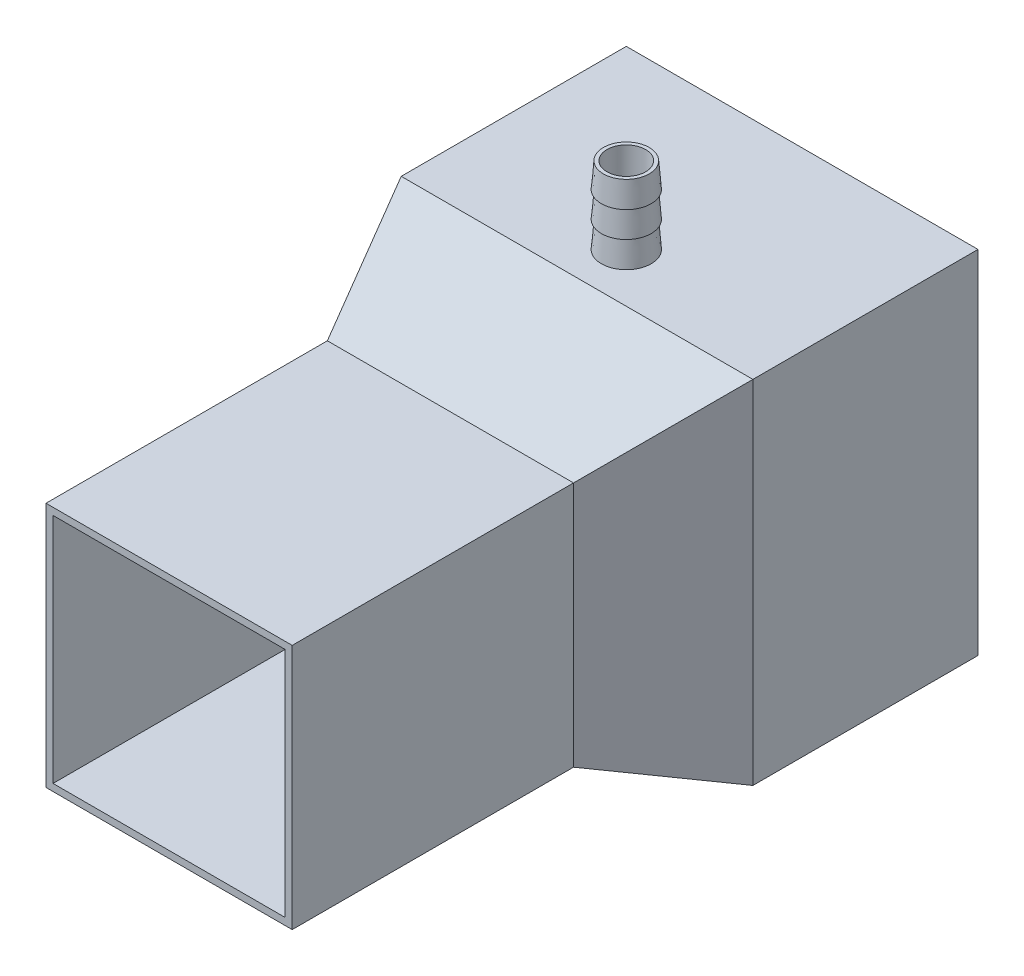
ISO-10303-21;
HEADER;
FILE_DESCRIPTION(('STEP AP214'),'2;1');
FILE_NAME('part.step','',(''),(''),'','','');
FILE_SCHEMA(('AUTOMOTIVE_DESIGN { 1 0 10303 214 1 1 1 1 }'));
ENDSEC;
DATA;
#1=APPLICATION_CONTEXT('core data for automotive mechanical design processes');
#2=APPLICATION_PROTOCOL_DEFINITION('international standard','automotive_design',2000,#1);
#3=PRODUCT_CONTEXT('',#1,'mechanical');
#4=PRODUCT('Part','Part','',(#3));
#5=PRODUCT_RELATED_PRODUCT_CATEGORY('part','',(#4));
#6=PRODUCT_DEFINITION_FORMATION('','',#4);
#7=PRODUCT_DEFINITION_CONTEXT('part definition',#1,'design');
#8=PRODUCT_DEFINITION('design','',#6,#7);
#9=PRODUCT_DEFINITION_SHAPE('','',#8);
#10=(LENGTH_UNIT() NAMED_UNIT(*) SI_UNIT(.MILLI.,.METRE.));
#11=(NAMED_UNIT(*) PLANE_ANGLE_UNIT() SI_UNIT($,.RADIAN.));
#12=(NAMED_UNIT(*) SI_UNIT($,.STERADIAN.) SOLID_ANGLE_UNIT());
#13=UNCERTAINTY_MEASURE_WITH_UNIT(LENGTH_MEASURE(1.E-05),#10,'distance_accuracy_value','');
#14=(GEOMETRIC_REPRESENTATION_CONTEXT(3) GLOBAL_UNCERTAINTY_ASSIGNED_CONTEXT((#13)) GLOBAL_UNIT_ASSIGNED_CONTEXT((#10,
#11,#12)) REPRESENTATION_CONTEXT('',''));
#15=CARTESIAN_POINT('',(0.,0.,0.));
#16=DIRECTION('',(0.,0.,1.));
#17=DIRECTION('',(1.,0.,0.));
#18=AXIS2_PLACEMENT_3D('',#15,#16,#17);
#19=CARTESIAN_POINT('',(0.,9.0728769426227,1.26984070723911));
#20=DIRECTION('',(0.,-1.,0.));
#21=DIRECTION('',(0.,0.,-1.));
#22=AXIS2_PLACEMENT_3D('',#19,#20,#21);
#23=PLANE('',#22);
#24=CARTESIAN_POINT('',(0.,9.0728769426227,-2.22044604925031E-13));
#25=DIRECTION('',(0.,1.,0.));
#26=DIRECTION('',(0.,0.,1.));
#27=AXIS2_PLACEMENT_3D('',#24,#25,#26);
#28=CIRCLE('',#27,2.75);
#29=CARTESIAN_POINT('',(0.,9.07287694262269,2.74999999999978));
#30=VERTEX_POINT('',#29);
#31=EDGE_CURVE('E83',#30,#30,#28,.T.);
#32=ORIENTED_EDGE('',*,*,#31,.T.);
#33=EDGE_LOOP('',(#32));
#34=FACE_BOUND('',#33,.T.);
#35=CARTESIAN_POINT('',(0.,9.0728769426227,-2.22044604925031E-13));
#36=DIRECTION('',(0.,-1.,0.));
#37=DIRECTION('',(0.,0.,-1.));
#38=AXIS2_PLACEMENT_3D('',#35,#36,#37);
#39=CIRCLE('',#38,3.2564997740311);
#40=CARTESIAN_POINT('',(0.,9.07287694262271,-3.25649977403132));
#41=VERTEX_POINT('',#40);
#42=EDGE_CURVE('E80',#41,#41,#39,.T.);
#43=ORIENTED_EDGE('',*,*,#42,.T.);
#44=EDGE_LOOP('',(#43));
#45=FACE_BOUND('',#44,.T.);
#46=ADVANCED_FACE('F58',(#34,#45),#23,.T.);
#47=CARTESIAN_POINT('',(0.,20.0000000000001,1.26984070723914));
#48=DIRECTION('',(0.,1.,0.));
#49=DIRECTION('',(0.,0.,1.));
#50=AXIS2_PLACEMENT_3D('',#47,#48,#49);
#51=PLANE('',#50);
#52=CARTESIAN_POINT('',(0.,20.0000000000001,-1.80411241501588E-13));
#53=DIRECTION('',(0.,1.,0.));
#54=DIRECTION('',(0.,0.,1.));
#55=AXIS2_PLACEMENT_3D('',#52,#53,#54);
#56=CIRCLE('',#55,2.75);
#57=CARTESIAN_POINT('',(0.,20.0000000000001,2.74999999999982));
#58=VERTEX_POINT('',#57);
#59=EDGE_CURVE('E84',#58,#58,#56,.T.);
#60=ORIENTED_EDGE('',*,*,#59,.F.);
#61=EDGE_LOOP('',(#60));
#62=FACE_BOUND('',#61,.T.);
#63=CARTESIAN_POINT('',(0.,20.0000000000001,-1.80411241501588E-13));
#64=DIRECTION('',(0.,-1.,0.));
#65=DIRECTION('',(0.,0.,-1.));
#66=AXIS2_PLACEMENT_3D('',#63,#64,#65);
#67=CIRCLE('',#66,3.53968141447866);
#68=CARTESIAN_POINT('',(0.,20.0000000000002,-3.53968141447884));
#69=VERTEX_POINT('',#68);
#70=EDGE_CURVE('E11',#69,#69,#67,.T.);
#71=ORIENTED_EDGE('',*,*,#70,.F.);
#72=EDGE_LOOP('',(#71));
#73=FACE_BOUND('',#72,.T.);
#74=ADVANCED_FACE('F99',(#62,#73),#51,.T.);
#75=CARTESIAN_POINT('',(0.,20.0000000000001,-1.80411241501588E-13));
#76=DIRECTION('',(0.,1.,0.));
#77=DIRECTION('',(0.,0.,1.));
#78=AXIS2_PLACEMENT_3D('',#75,#76,#77);
#79=CONICAL_SURFACE('',#78,3.53968141447866,0.0792126806704468);
#80=CARTESIAN_POINT('',(0.,16.2858146268847,-1.94289029309402E-13));
#81=DIRECTION('',(0.,-1.,0.));
#82=DIRECTION('',(0.,0.,-1.));
#83=AXIS2_PLACEMENT_3D('',#80,#81,#82);
#84=CIRCLE('',#83,3.24485393015888);
#85=CARTESIAN_POINT('',(0.,16.2858146268847,-3.24485393015907));
#86=VERTEX_POINT('',#85);
#87=EDGE_CURVE('E64',#86,#86,#84,.T.);
#88=ORIENTED_EDGE('',*,*,#87,.F.);
#89=EDGE_LOOP('',(#88));
#90=FACE_BOUND('',#89,.T.);
#91=ORIENTED_EDGE('',*,*,#70,.T.);
#92=EDGE_LOOP('',(#91));
#93=FACE_BOUND('',#92,.T.);
#94=ADVANCED_FACE('F102',(#90,#93),#79,.T.);
#95=CARTESIAN_POINT('',(0.,16.2858146268847,1.26984070723913));
#96=DIRECTION('',(0.,-1.,0.));
#97=DIRECTION('',(0.,0.,-1.));
#98=AXIS2_PLACEMENT_3D('',#95,#96,#97);
#99=PLANE('',#98);
#100=CARTESIAN_POINT('',(0.,16.2858146268847,-1.94289029309402E-13));
#101=DIRECTION('',(0.,-1.,0.));
#102=DIRECTION('',(0.,0.,-1.));
#103=AXIS2_PLACEMENT_3D('',#100,#101,#102);
#104=CIRCLE('',#103,3.53695393015888);
#105=CARTESIAN_POINT('',(0.,16.2858146268847,-3.53695393015907));
#106=VERTEX_POINT('',#105);
#107=EDGE_CURVE('E68',#106,#106,#104,.T.);
#108=ORIENTED_EDGE('',*,*,#107,.F.);
#109=EDGE_LOOP('',(#108));
#110=FACE_BOUND('',#109,.T.);
#111=ORIENTED_EDGE('',*,*,#87,.T.);
#112=EDGE_LOOP('',(#111));
#113=FACE_BOUND('',#112,.T.);
#114=ADVANCED_FACE('F107',(#110,#113),#99,.F.);
#115=CARTESIAN_POINT('',(0.,16.2858146268847,-1.94289029309402E-13));
#116=DIRECTION('',(0.,1.,0.));
#117=DIRECTION('',(0.,0.,1.));
#118=AXIS2_PLACEMENT_3D('',#115,#116,#117);
#119=CONICAL_SURFACE('',#118,3.53695393015888,0.0792126806704446);
#120=CARTESIAN_POINT('',(0.,12.6059896268847,-2.08166817117217E-13));
#121=DIRECTION('',(0.,-1.,0.));
#122=DIRECTION('',(0.,0.,-1.));
#123=AXIS2_PLACEMENT_3D('',#120,#121,#122);
#124=CIRCLE('',#123,3.24485393015888);
#125=CARTESIAN_POINT('',(0.,12.6059896268847,-3.24485393015909));
#126=VERTEX_POINT('',#125);
#127=EDGE_CURVE('E72',#126,#126,#124,.T.);
#128=ORIENTED_EDGE('',*,*,#127,.F.);
#129=EDGE_LOOP('',(#128));
#130=FACE_BOUND('',#129,.T.);
#131=ORIENTED_EDGE('',*,*,#107,.T.);
#132=EDGE_LOOP('',(#131));
#133=FACE_BOUND('',#132,.T.);
#134=ADVANCED_FACE('F113',(#130,#133),#119,.T.);
#135=CARTESIAN_POINT('',(0.,12.6059896268847,1.26984070723912));
#136=DIRECTION('',(0.,-1.,0.));
#137=DIRECTION('',(0.,0.,-1.));
#138=AXIS2_PLACEMENT_3D('',#135,#136,#137);
#139=PLANE('',#138);
#140=CARTESIAN_POINT('',(0.,12.6059896268847,-2.08166817117217E-13));
#141=DIRECTION('',(0.,-1.,0.));
#142=DIRECTION('',(0.,0.,-1.));
#143=AXIS2_PLACEMENT_3D('',#140,#141,#142);
#144=CIRCLE('',#143,3.53695393015888);
#145=CARTESIAN_POINT('',(0.,12.6059896268847,-3.53695393015909));
#146=VERTEX_POINT('',#145);
#147=EDGE_CURVE('E77',#146,#146,#144,.T.);
#148=ORIENTED_EDGE('',*,*,#147,.F.);
#149=EDGE_LOOP('',(#148));
#150=FACE_BOUND('',#149,.T.);
#151=ORIENTED_EDGE('',*,*,#127,.T.);
#152=EDGE_LOOP('',(#151));
#153=FACE_BOUND('',#152,.T.);
#154=ADVANCED_FACE('F117',(#150,#153),#139,.F.);
#155=CARTESIAN_POINT('',(0.,12.6059896268847,-2.08166817117217E-13));
#156=DIRECTION('',(0.,1.,0.));
#157=DIRECTION('',(0.,0.,1.));
#158=AXIS2_PLACEMENT_3D('',#155,#156,#157);
#159=CONICAL_SURFACE('',#158,3.53695393015888,0.0792126806704447);
#160=ORIENTED_EDGE('',*,*,#42,.F.);
#161=EDGE_LOOP('',(#160));
#162=FACE_BOUND('',#161,.T.);
#163=ORIENTED_EDGE('',*,*,#147,.T.);
#164=EDGE_LOOP('',(#163));
#165=FACE_BOUND('',#164,.T.);
#166=ADVANCED_FACE('F95',(#162,#165),#159,.T.);
#167=CARTESIAN_POINT('',(0.,9.0728769426227,-2.22044604925031E-13));
#168=DIRECTION('',(0.,1.,0.));
#169=DIRECTION('',(0.,0.,1.));
#170=AXIS2_PLACEMENT_3D('',#167,#168,#169);
#171=CYLINDRICAL_SURFACE('',#170,2.75);
#172=ORIENTED_EDGE('',*,*,#31,.F.);
#173=EDGE_LOOP('',(#172));
#174=FACE_BOUND('',#173,.T.);
#175=ORIENTED_EDGE('',*,*,#59,.T.);
#176=EDGE_LOOP('',(#175));
#177=FACE_BOUND('',#176,.T.);
#178=ADVANCED_FACE('F92',(#174,#177),#171,.F.);
#179=CLOSED_SHELL('',(#46,#74,#94,#114,#134,#154,#166,#178));
#180=MANIFOLD_SOLID_BREP('B2',#179);
#181=CARTESIAN_POINT('',(0.,80.9271230573773,-1.26984070723988));
#182=DIRECTION('',(0.,1.,0.));
#183=DIRECTION('',(0.,0.,1.));
#184=AXIS2_PLACEMENT_3D('',#181,#182,#183);
#185=PLANE('',#184);
#186=CARTESIAN_POINT('',(0.,80.9271230573773,-5.62050406216485E-13));
#187=DIRECTION('',(0.,-1.,0.));
#188=DIRECTION('',(0.,0.,-1.));
#189=AXIS2_PLACEMENT_3D('',#186,#187,#188);
#190=CIRCLE('',#189,2.75);
#191=CARTESIAN_POINT('',(0.,80.9271230573773,-2.75000000000056));
#192=VERTEX_POINT('',#191);
#193=EDGE_CURVE('E220',#192,#192,#190,.T.);
#194=ORIENTED_EDGE('',*,*,#193,.T.);
#195=EDGE_LOOP('',(#194));
#196=FACE_BOUND('',#195,.T.);
#197=CARTESIAN_POINT('',(0.,80.9271230573773,-5.62050406216485E-13));
#198=DIRECTION('',(0.,1.,0.));
#199=DIRECTION('',(0.,0.,1.));
#200=AXIS2_PLACEMENT_3D('',#197,#198,#199);
#201=CIRCLE('',#200,3.2564997740311);
#202=CARTESIAN_POINT('',(0.,80.9271230573774,3.25649977403054));
#203=VERTEX_POINT('',#202);
#204=EDGE_CURVE('E217',#203,#203,#201,.T.);
#205=ORIENTED_EDGE('',*,*,#204,.T.);
#206=EDGE_LOOP('',(#205));
#207=FACE_BOUND('',#206,.T.);
#208=ADVANCED_FACE('F195',(#196,#207),#185,.T.);
#209=CARTESIAN_POINT('',(0.,69.9999999999999,-1.26984070723982));
#210=DIRECTION('',(0.,-1.,0.));
#211=DIRECTION('',(0.,0.,-1.));
#212=AXIS2_PLACEMENT_3D('',#209,#210,#211);
#213=PLANE('',#212);
#214=CARTESIAN_POINT('',(0.,69.9999999999999,-5.06539254985228E-13));
#215=DIRECTION('',(0.,-1.,0.));
#216=DIRECTION('',(0.,0.,-1.));
#217=AXIS2_PLACEMENT_3D('',#214,#215,#216);
#218=CIRCLE('',#217,2.75);
#219=CARTESIAN_POINT('',(0.,69.9999999999999,-2.75000000000051));
#220=VERTEX_POINT('',#219);
#221=EDGE_CURVE('E221',#220,#220,#218,.T.);
#222=ORIENTED_EDGE('',*,*,#221,.F.);
#223=EDGE_LOOP('',(#222));
#224=FACE_BOUND('',#223,.T.);
#225=CARTESIAN_POINT('',(0.,69.9999999999999,-5.06539254985228E-13));
#226=DIRECTION('',(0.,1.,0.));
#227=DIRECTION('',(0.,0.,1.));
#228=AXIS2_PLACEMENT_3D('',#225,#226,#227);
#229=CIRCLE('',#228,3.53968141447866);
#230=CARTESIAN_POINT('',(0.,69.9999999999999,3.53968141447815));
#231=VERTEX_POINT('',#230);
#232=EDGE_CURVE('E57',#231,#231,#229,.T.);
#233=ORIENTED_EDGE('',*,*,#232,.F.);
#234=EDGE_LOOP('',(#233));
#235=FACE_BOUND('',#234,.T.);
#236=ADVANCED_FACE('F236',(#224,#235),#213,.T.);
#237=CARTESIAN_POINT('',(0.,69.9999999999999,-5.06539254985228E-13));
#238=DIRECTION('',(0.,-1.,0.));
#239=DIRECTION('',(0.,0.,-1.));
#240=AXIS2_PLACEMENT_3D('',#237,#238,#239);
#241=CONICAL_SURFACE('',#240,3.53968141447866,0.0792126806704468);
#242=CARTESIAN_POINT('',(0.,73.7141853731154,-5.34294830600857E-13));
#243=DIRECTION('',(0.,1.,0.));
#244=DIRECTION('',(0.,0.,1.));
#245=AXIS2_PLACEMENT_3D('',#242,#243,#244);
#246=CIRCLE('',#245,3.24485393015888);
#247=CARTESIAN_POINT('',(0.,73.7141853731154,3.24485393015834));
#248=VERTEX_POINT('',#247);
#249=EDGE_CURVE('E201',#248,#248,#246,.T.);
#250=ORIENTED_EDGE('',*,*,#249,.F.);
#251=EDGE_LOOP('',(#250));
#252=FACE_BOUND('',#251,.T.);
#253=ORIENTED_EDGE('',*,*,#232,.T.);
#254=EDGE_LOOP('',(#253));
#255=FACE_BOUND('',#254,.T.);
#256=ADVANCED_FACE('F239',(#252,#255),#241,.T.);
#257=CARTESIAN_POINT('',(0.,73.7141853731154,-1.26984070723985));
#258=DIRECTION('',(0.,1.,0.));
#259=DIRECTION('',(0.,0.,1.));
#260=AXIS2_PLACEMENT_3D('',#257,#258,#259);
#261=PLANE('',#260);
#262=CARTESIAN_POINT('',(0.,73.7141853731154,-5.34294830600857E-13));
#263=DIRECTION('',(0.,1.,0.));
#264=DIRECTION('',(0.,0.,1.));
#265=AXIS2_PLACEMENT_3D('',#262,#263,#264);
#266=CIRCLE('',#265,3.53695393015888);
#267=CARTESIAN_POINT('',(0.,73.7141853731154,3.53695393015834));
#268=VERTEX_POINT('',#267);
#269=EDGE_CURVE('E205',#268,#268,#266,.T.);
#270=ORIENTED_EDGE('',*,*,#269,.F.);
#271=EDGE_LOOP('',(#270));
#272=FACE_BOUND('',#271,.T.);
#273=ORIENTED_EDGE('',*,*,#249,.T.);
#274=EDGE_LOOP('',(#273));
#275=FACE_BOUND('',#274,.T.);
#276=ADVANCED_FACE('F244',(#272,#275),#261,.F.);
#277=CARTESIAN_POINT('',(0.,73.7141853731154,-5.34294830600857E-13));
#278=DIRECTION('',(0.,-1.,0.));
#279=DIRECTION('',(0.,0.,-1.));
#280=AXIS2_PLACEMENT_3D('',#277,#278,#279);
#281=CONICAL_SURFACE('',#280,3.53695393015888,0.0792126806704446);
#282=CARTESIAN_POINT('',(0.,77.3940103731154,-5.34294830600857E-13));
#283=DIRECTION('',(0.,1.,0.));
#284=DIRECTION('',(0.,0.,1.));
#285=AXIS2_PLACEMENT_3D('',#282,#283,#284);
#286=CIRCLE('',#285,3.24485393015888);
#287=CARTESIAN_POINT('',(0.,77.3940103731154,3.24485393015834));
#288=VERTEX_POINT('',#287);
#289=EDGE_CURVE('E209',#288,#288,#286,.T.);
#290=ORIENTED_EDGE('',*,*,#289,.F.);
#291=EDGE_LOOP('',(#290));
#292=FACE_BOUND('',#291,.T.);
#293=ORIENTED_EDGE('',*,*,#269,.T.);
#294=EDGE_LOOP('',(#293));
#295=FACE_BOUND('',#294,.T.);
#296=ADVANCED_FACE('F250',(#292,#295),#281,.T.);
#297=CARTESIAN_POINT('',(0.,77.3940103731154,-1.26984070723985));
#298=DIRECTION('',(0.,1.,0.));
#299=DIRECTION('',(0.,0.,1.));
#300=AXIS2_PLACEMENT_3D('',#297,#298,#299);
#301=PLANE('',#300);
#302=CARTESIAN_POINT('',(0.,77.3940103731154,-5.34294830600857E-13));
#303=DIRECTION('',(0.,1.,0.));
#304=DIRECTION('',(0.,0.,1.));
#305=AXIS2_PLACEMENT_3D('',#302,#303,#304);
#306=CIRCLE('',#305,3.53695393015888);
#307=CARTESIAN_POINT('',(0.,77.3940103731154,3.53695393015835));
#308=VERTEX_POINT('',#307);
#309=EDGE_CURVE('E214',#308,#308,#306,.T.);
#310=ORIENTED_EDGE('',*,*,#309,.F.);
#311=EDGE_LOOP('',(#310));
#312=FACE_BOUND('',#311,.T.);
#313=ORIENTED_EDGE('',*,*,#289,.T.);
#314=EDGE_LOOP('',(#313));
#315=FACE_BOUND('',#314,.T.);
#316=ADVANCED_FACE('F254',(#312,#315),#301,.F.);
#317=CARTESIAN_POINT('',(0.,77.3940103731154,-5.34294830600857E-13));
#318=DIRECTION('',(0.,-1.,0.));
#319=DIRECTION('',(0.,0.,-1.));
#320=AXIS2_PLACEMENT_3D('',#317,#318,#319);
#321=CONICAL_SURFACE('',#320,3.53695393015888,0.0792126806704447);
#322=ORIENTED_EDGE('',*,*,#204,.F.);
#323=EDGE_LOOP('',(#322));
#324=FACE_BOUND('',#323,.T.);
#325=ORIENTED_EDGE('',*,*,#309,.T.);
#326=EDGE_LOOP('',(#325));
#327=FACE_BOUND('',#326,.T.);
#328=ADVANCED_FACE('F232',(#324,#327),#321,.T.);
#329=CARTESIAN_POINT('',(0.,80.9271230573773,-5.62050406216485E-13));
#330=DIRECTION('',(0.,-1.,0.));
#331=DIRECTION('',(0.,0.,-1.));
#332=AXIS2_PLACEMENT_3D('',#329,#330,#331);
#333=CYLINDRICAL_SURFACE('',#332,2.75);
#334=ORIENTED_EDGE('',*,*,#193,.F.);
#335=EDGE_LOOP('',(#334));
#336=FACE_BOUND('',#335,.T.);
#337=ORIENTED_EDGE('',*,*,#221,.T.);
#338=EDGE_LOOP('',(#337));
#339=FACE_BOUND('',#338,.T.);
#340=ADVANCED_FACE('F229',(#336,#339),#333,.F.);
#341=CLOSED_SHELL('',(#208,#236,#256,#276,#296,#316,#328,#340));
#342=MANIFOLD_SOLID_BREP('B6',#341);
#343=CARTESIAN_POINT('',(25.,70.,25.));
#344=DIRECTION('',(-1.,0.,0.));
#345=DIRECTION('',(0.,0.,1.));
#346=AXIS2_PLACEMENT_3D('',#343,#344,#345);
#347=PLANE('',#346);
#348=DIRECTION('',(0.,0.,-1.));
#349=VECTOR('',#348,1.);
#350=CARTESIAN_POINT('',(25.,70.,25.));
#351=LINE('',#350,#349);
#352=CARTESIAN_POINT('',(25.,70.,7.));
#353=VERTEX_POINT('',#352);
#354=CARTESIAN_POINT('',(25.,70.,-25.));
#355=VERTEX_POINT('',#354);
#356=EDGE_CURVE('E631',#353,#355,#351,.T.);
#357=ORIENTED_EDGE('',*,*,#356,.F.);
#358=DIRECTION('',(0.,-1.,0.));
#359=VECTOR('',#358,1.);
#360=CARTESIAN_POINT('',(25.,70.,7.));
#361=LINE('',#360,#359);
#362=CARTESIAN_POINT('',(25.,20.,7.));
#363=VERTEX_POINT('',#362);
#364=EDGE_CURVE('E523',#353,#363,#361,.T.);
#365=ORIENTED_EDGE('',*,*,#364,.T.);
#366=DIRECTION('',(0.,0.,-1.));
#367=VECTOR('',#366,1.);
#368=CARTESIAN_POINT('',(25.,20.,25.));
#369=LINE('',#368,#367);
#370=CARTESIAN_POINT('',(25.,20.,-25.));
#371=VERTEX_POINT('',#370);
#372=EDGE_CURVE('E630',#363,#371,#369,.T.);
#373=ORIENTED_EDGE('',*,*,#372,.T.);
#374=DIRECTION('',(0.,-1.,0.));
#375=VECTOR('',#374,1.);
#376=CARTESIAN_POINT('',(25.,70.,-25.));
#377=LINE('',#376,#375);
#378=EDGE_CURVE('E654',#355,#371,#377,.T.);
#379=ORIENTED_EDGE('',*,*,#378,.F.);
#380=EDGE_LOOP('',(#357,#365,#373,#379));
#381=FACE_BOUND('',#380,.T.);
#382=ADVANCED_FACE('F323',(#381),#347,.F.);
#383=CARTESIAN_POINT('',(-25.,70.,-25.));
#384=DIRECTION('',(0.,0.,-1.));
#385=DIRECTION('',(-1.,0.,0.));
#386=AXIS2_PLACEMENT_3D('',#383,#384,#385);
#387=PLANE('',#386);
#388=DIRECTION('',(1.,0.,0.));
#389=VECTOR('',#388,1.);
#390=CARTESIAN_POINT('',(-25.,20.,-25.));
#391=LINE('',#390,#389);
#392=CARTESIAN_POINT('',(-25.,20.,-25.));
#393=VERTEX_POINT('',#392);
#394=EDGE_CURVE('E645',#393,#371,#391,.T.);
#395=ORIENTED_EDGE('',*,*,#394,.F.);
#396=DIRECTION('',(0.,-1.,0.));
#397=VECTOR('',#396,1.);
#398=CARTESIAN_POINT('',(-25.,70.,-25.));
#399=LINE('',#398,#397);
#400=CARTESIAN_POINT('',(-25.,70.,-25.));
#401=VERTEX_POINT('',#400);
#402=EDGE_CURVE('E642',#401,#393,#399,.T.);
#403=ORIENTED_EDGE('',*,*,#402,.F.);
#404=DIRECTION('',(1.,0.,0.));
#405=VECTOR('',#404,1.);
#406=CARTESIAN_POINT('',(-25.,70.,-25.));
#407=LINE('',#406,#405);
#408=EDGE_CURVE('E634',#401,#355,#407,.T.);
#409=ORIENTED_EDGE('',*,*,#408,.T.);
#410=ORIENTED_EDGE('',*,*,#378,.T.);
#411=EDGE_LOOP('',(#395,#403,#409,#410));
#412=FACE_BOUND('',#411,.T.);
#413=ADVANCED_FACE('F676',(#412),#387,.T.);
#414=CARTESIAN_POINT('',(-25.,70.,25.));
#415=DIRECTION('',(-1.,0.,0.));
#416=DIRECTION('',(0.,0.,1.));
#417=AXIS2_PLACEMENT_3D('',#414,#415,#416);
#418=PLANE('',#417);
#419=DIRECTION('',(0.,-1.,0.));
#420=VECTOR('',#419,1.);
#421=CARTESIAN_POINT('',(-25.,70.,7.));
#422=LINE('',#421,#420);
#423=CARTESIAN_POINT('',(-25.,70.,7.));
#424=VERTEX_POINT('',#423);
#425=CARTESIAN_POINT('',(-25.,20.,7.));
#426=VERTEX_POINT('',#425);
#427=EDGE_CURVE('E524',#424,#426,#422,.T.);
#428=ORIENTED_EDGE('',*,*,#427,.F.);
#429=DIRECTION('',(0.,0.,-1.));
#430=VECTOR('',#429,1.);
#431=CARTESIAN_POINT('',(-25.,70.,25.));
#432=LINE('',#431,#430);
#433=EDGE_CURVE('E639',#424,#401,#432,.T.);
#434=ORIENTED_EDGE('',*,*,#433,.T.);
#435=ORIENTED_EDGE('',*,*,#402,.T.);
#436=DIRECTION('',(0.,0.,-1.));
#437=VECTOR('',#436,1.);
#438=CARTESIAN_POINT('',(-25.,20.,25.));
#439=LINE('',#438,#437);
#440=EDGE_CURVE('E635',#426,#393,#439,.T.);
#441=ORIENTED_EDGE('',*,*,#440,.F.);
#442=EDGE_LOOP('',(#428,#434,#435,#441));
#443=FACE_BOUND('',#442,.T.);
#444=ADVANCED_FACE('F680',(#443),#418,.T.);
#445=CARTESIAN_POINT('',(0.,70.,0.));
#446=DIRECTION('',(0.,1.,0.));
#447=DIRECTION('',(0.,0.,1.));
#448=AXIS2_PLACEMENT_3D('',#445,#446,#447);
#449=PLANE('',#448);
#450=CARTESIAN_POINT('',(0.,70.,0.));
#451=DIRECTION('',(0.,1.,0.));
#452=DIRECTION('',(0.,0.,1.));
#453=AXIS2_PLACEMENT_3D('',#450,#451,#452);
#454=CIRCLE('',#453,2.75);
#455=CARTESIAN_POINT('',(0.,70.,2.75));
#456=VERTEX_POINT('',#455);
#457=EDGE_CURVE('E971',#456,#456,#454,.T.);
#458=ORIENTED_EDGE('',*,*,#457,.F.);
#459=EDGE_LOOP('',(#458));
#460=FACE_BOUND('',#459,.T.);
#461=DIRECTION('',(1.,0.,0.));
#462=VECTOR('',#461,1.);
#463=CARTESIAN_POINT('',(-25.,70.,7.));
#464=LINE('',#463,#462);
#465=EDGE_CURVE('E539',#424,#353,#464,.T.);
#466=ORIENTED_EDGE('',*,*,#465,.T.);
#467=ORIENTED_EDGE('',*,*,#356,.T.);
#468=ORIENTED_EDGE('',*,*,#408,.F.);
#469=ORIENTED_EDGE('',*,*,#433,.F.);
#470=EDGE_LOOP('',(#466,#467,#468,#469));
#471=FACE_BOUND('',#470,.T.);
#472=ADVANCED_FACE('F668',(#460,#471),#449,.T.);
#473=CARTESIAN_POINT('',(0.,20.,0.));
#474=DIRECTION('',(0.,1.,0.));
#475=DIRECTION('',(0.,0.,1.));
#476=AXIS2_PLACEMENT_3D('',#473,#474,#475);
#477=PLANE('',#476);
#478=CARTESIAN_POINT('',(0.,20.,0.));
#479=DIRECTION('',(0.,1.,0.));
#480=DIRECTION('',(0.,0.,1.));
#481=AXIS2_PLACEMENT_3D('',#478,#479,#480);
#482=CIRCLE('',#481,2.75);
#483=CARTESIAN_POINT('',(0.,20.,2.75));
#484=VERTEX_POINT('',#483);
#485=EDGE_CURVE('E981',#484,#484,#482,.T.);
#486=ORIENTED_EDGE('',*,*,#485,.T.);
#487=EDGE_LOOP('',(#486));
#488=FACE_BOUND('',#487,.T.);
#489=ORIENTED_EDGE('',*,*,#372,.F.);
#490=DIRECTION('',(1.,0.,0.));
#491=VECTOR('',#490,1.);
#492=CARTESIAN_POINT('',(-25.,20.,7.));
#493=LINE('',#492,#491);
#494=EDGE_CURVE('E538',#426,#363,#493,.T.);
#495=ORIENTED_EDGE('',*,*,#494,.F.);
#496=ORIENTED_EDGE('',*,*,#440,.T.);
#497=ORIENTED_EDGE('',*,*,#394,.T.);
#498=EDGE_LOOP('',(#489,#495,#496,#497));
#499=FACE_BOUND('',#498,.T.);
#500=ADVANCED_FACE('F687',(#488,#499),#477,.F.);
#501=CARTESIAN_POINT('',(0.,0.,65.));
#502=DIRECTION('',(0.,0.,-1.));
#503=DIRECTION('',(-1.,0.,0.));
#504=AXIS2_PLACEMENT_3D('',#501,#502,#503);
#505=PLANE('',#504);
#506=DIRECTION('',(0.,1.,0.));
#507=VECTOR('',#506,1.);
#508=CARTESIAN_POINT('',(17.5,27.5,65.));
#509=LINE('',#508,#507);
#510=CARTESIAN_POINT('',(17.5,27.5,65.));
#511=VERTEX_POINT('',#510);
#512=CARTESIAN_POINT('',(17.5,62.5,65.));
#513=VERTEX_POINT('',#512);
#514=EDGE_CURVE('E588',#511,#513,#509,.T.);
#515=ORIENTED_EDGE('',*,*,#514,.T.);
#516=DIRECTION('',(-1.,0.,0.));
#517=VECTOR('',#516,1.);
#518=CARTESIAN_POINT('',(-17.5,62.5,65.));
#519=LINE('',#518,#517);
#520=CARTESIAN_POINT('',(-17.5,62.5,65.));
#521=VERTEX_POINT('',#520);
#522=EDGE_CURVE('E592',#513,#521,#519,.T.);
#523=ORIENTED_EDGE('',*,*,#522,.T.);
#524=DIRECTION('',(0.,-1.,0.));
#525=VECTOR('',#524,1.);
#526=CARTESIAN_POINT('',(-17.5,27.5,65.));
#527=LINE('',#526,#525);
#528=CARTESIAN_POINT('',(-17.5,27.5,65.));
#529=VERTEX_POINT('',#528);
#530=EDGE_CURVE('E596',#521,#529,#527,.T.);
#531=ORIENTED_EDGE('',*,*,#530,.T.);
#532=DIRECTION('',(1.,0.,0.));
#533=VECTOR('',#532,1.);
#534=CARTESIAN_POINT('',(-17.5,27.5,65.));
#535=LINE('',#534,#533);
#536=EDGE_CURVE('E599',#529,#511,#535,.T.);
#537=ORIENTED_EDGE('',*,*,#536,.T.);
#538=EDGE_LOOP('',(#515,#523,#531,#537));
#539=FACE_BOUND('',#538,.T.);
#540=DIRECTION('',(0.,1.,0.));
#541=VECTOR('',#540,1.);
#542=CARTESIAN_POINT('',(16.5,28.5,65.));
#543=LINE('',#542,#541);
#544=CARTESIAN_POINT('',(16.5,28.5,65.));
#545=VERTEX_POINT('',#544);
#546=CARTESIAN_POINT('',(16.5,61.5,65.));
#547=VERTEX_POINT('',#546);
#548=EDGE_CURVE('E562',#545,#547,#543,.T.);
#549=ORIENTED_EDGE('',*,*,#548,.F.);
#550=DIRECTION('',(1.,0.,0.));
#551=VECTOR('',#550,1.);
#552=CARTESIAN_POINT('',(-16.5,28.5,65.));
#553=LINE('',#552,#551);
#554=CARTESIAN_POINT('',(-16.5,28.5,65.));
#555=VERTEX_POINT('',#554);
#556=EDGE_CURVE('E572',#555,#545,#553,.T.);
#557=ORIENTED_EDGE('',*,*,#556,.F.);
#558=DIRECTION('',(0.,-1.,0.));
#559=VECTOR('',#558,1.);
#560=CARTESIAN_POINT('',(-16.5,28.5,65.));
#561=LINE('',#560,#559);
#562=CARTESIAN_POINT('',(-16.5,61.5,65.));
#563=VERTEX_POINT('',#562);
#564=EDGE_CURVE('E568',#563,#555,#561,.T.);
#565=ORIENTED_EDGE('',*,*,#564,.F.);
#566=DIRECTION('',(-1.,0.,0.));
#567=VECTOR('',#566,1.);
#568=CARTESIAN_POINT('',(-16.5,61.5,65.));
#569=LINE('',#568,#567);
#570=EDGE_CURVE('E565',#547,#563,#569,.T.);
#571=ORIENTED_EDGE('',*,*,#570,.F.);
#572=EDGE_LOOP('',(#549,#557,#565,#571));
#573=FACE_BOUND('',#572,.T.);
#574=ADVANCED_FACE('F689',(#539,#573),#505,.F.);
#575=CARTESIAN_POINT('',(17.5,27.5,65.));
#576=DIRECTION('',(-1.,0.,0.));
#577=DIRECTION('',(0.,0.,1.));
#578=AXIS2_PLACEMENT_3D('',#575,#576,#577);
#579=PLANE('',#578);
#580=DIRECTION('',(0.,1.,0.));
#581=VECTOR('',#580,1.);
#582=CARTESIAN_POINT('',(17.5,27.5,25.));
#583=LINE('',#582,#581);
#584=CARTESIAN_POINT('',(17.5,27.5,25.));
#585=VERTEX_POINT('',#584);
#586=CARTESIAN_POINT('',(17.5,62.5,25.));
#587=VERTEX_POINT('',#586);
#588=EDGE_CURVE('E587',#585,#587,#583,.T.);
#589=ORIENTED_EDGE('',*,*,#588,.T.);
#590=DIRECTION('',(0.,0.,-1.));
#591=VECTOR('',#590,1.);
#592=CARTESIAN_POINT('',(17.5,62.5,65.));
#593=LINE('',#592,#591);
#594=EDGE_CURVE('E626',#513,#587,#593,.T.);
#595=ORIENTED_EDGE('',*,*,#594,.F.);
#596=ORIENTED_EDGE('',*,*,#514,.F.);
#597=DIRECTION('',(0.,0.,-1.));
#598=VECTOR('',#597,1.);
#599=CARTESIAN_POINT('',(17.5,27.5,65.));
#600=LINE('',#599,#598);
#601=EDGE_CURVE('E602',#511,#585,#600,.T.);
#602=ORIENTED_EDGE('',*,*,#601,.T.);
#603=EDGE_LOOP('',(#589,#595,#596,#602));
#604=FACE_BOUND('',#603,.T.);
#605=ADVANCED_FACE('F697',(#604),#579,.F.);
#606=CARTESIAN_POINT('',(-17.5,62.5,65.));
#607=DIRECTION('',(0.,-1.,0.));
#608=DIRECTION('',(0.,0.,-1.));
#609=AXIS2_PLACEMENT_3D('',#606,#607,#608);
#610=PLANE('',#609);
#611=DIRECTION('',(-1.,0.,0.));
#612=VECTOR('',#611,1.);
#613=CARTESIAN_POINT('',(-17.5,62.5,25.));
#614=LINE('',#613,#612);
#615=CARTESIAN_POINT('',(-17.5,62.5,25.));
#616=VERTEX_POINT('',#615);
#617=EDGE_CURVE('E606',#587,#616,#614,.T.);
#618=ORIENTED_EDGE('',*,*,#617,.T.);
#619=DIRECTION('',(0.,0.,-1.));
#620=VECTOR('',#619,1.);
#621=CARTESIAN_POINT('',(-17.5,62.5,65.));
#622=LINE('',#621,#620);
#623=EDGE_CURVE('E622',#521,#616,#622,.T.);
#624=ORIENTED_EDGE('',*,*,#623,.F.);
#625=ORIENTED_EDGE('',*,*,#522,.F.);
#626=ORIENTED_EDGE('',*,*,#594,.T.);
#627=EDGE_LOOP('',(#618,#624,#625,#626));
#628=FACE_BOUND('',#627,.T.);
#629=ADVANCED_FACE('F722',(#628),#610,.F.);
#630=CARTESIAN_POINT('',(-17.5,27.5,65.));
#631=DIRECTION('',(1.,0.,0.));
#632=DIRECTION('',(0.,0.,-1.));
#633=AXIS2_PLACEMENT_3D('',#630,#631,#632);
#634=PLANE('',#633);
#635=DIRECTION('',(0.,-1.,0.));
#636=VECTOR('',#635,1.);
#637=CARTESIAN_POINT('',(-17.5,27.5,25.));
#638=LINE('',#637,#636);
#639=CARTESIAN_POINT('',(-17.5,27.5,25.));
#640=VERTEX_POINT('',#639);
#641=EDGE_CURVE('E347',#616,#640,#638,.T.);
#642=ORIENTED_EDGE('',*,*,#641,.T.);
#643=DIRECTION('',(0.,0.,-1.));
#644=VECTOR('',#643,1.);
#645=CARTESIAN_POINT('',(-17.5,27.5,65.));
#646=LINE('',#645,#644);
#647=EDGE_CURVE('E618',#529,#640,#646,.T.);
#648=ORIENTED_EDGE('',*,*,#647,.F.);
#649=ORIENTED_EDGE('',*,*,#530,.F.);
#650=ORIENTED_EDGE('',*,*,#623,.T.);
#651=EDGE_LOOP('',(#642,#648,#649,#650));
#652=FACE_BOUND('',#651,.T.);
#653=ADVANCED_FACE('F732',(#652),#634,.F.);
#654=CARTESIAN_POINT('',(-17.5,27.5,65.));
#655=DIRECTION('',(0.,1.,0.));
#656=DIRECTION('',(0.,0.,1.));
#657=AXIS2_PLACEMENT_3D('',#654,#655,#656);
#658=PLANE('',#657);
#659=DIRECTION('',(1.,0.,0.));
#660=VECTOR('',#659,1.);
#661=CARTESIAN_POINT('',(-17.5,27.5,25.));
#662=LINE('',#661,#660);
#663=EDGE_CURVE('E593',#640,#585,#662,.T.);
#664=ORIENTED_EDGE('',*,*,#663,.T.);
#665=ORIENTED_EDGE('',*,*,#601,.F.);
#666=ORIENTED_EDGE('',*,*,#536,.F.);
#667=ORIENTED_EDGE('',*,*,#647,.T.);
#668=EDGE_LOOP('',(#664,#665,#666,#667));
#669=FACE_BOUND('',#668,.T.);
#670=ADVANCED_FACE('F741',(#669),#658,.F.);
#671=CARTESIAN_POINT('',(16.5,28.5,65.));
#672=DIRECTION('',(-1.,0.,0.));
#673=DIRECTION('',(0.,0.,1.));
#674=AXIS2_PLACEMENT_3D('',#671,#672,#673);
#675=PLANE('',#674);
#676=DIRECTION('',(0.,0.,-1.));
#677=VECTOR('',#676,1.);
#678=CARTESIAN_POINT('',(16.5,61.5,65.));
#679=LINE('',#678,#677);
#680=CARTESIAN_POINT('',(16.5,61.5,23.));
#681=VERTEX_POINT('',#680);
#682=EDGE_CURVE('E584',#547,#681,#679,.T.);
#683=ORIENTED_EDGE('',*,*,#682,.T.);
#684=DIRECTION('',(0.,1.,0.));
#685=VECTOR('',#684,1.);
#686=CARTESIAN_POINT('',(16.5,0.,23.));
#687=LINE('',#686,#685);
#688=CARTESIAN_POINT('',(16.5,28.5,23.));
#689=VERTEX_POINT('',#688);
#690=EDGE_CURVE('E550',#689,#681,#687,.T.);
#691=ORIENTED_EDGE('',*,*,#690,.F.);
#692=DIRECTION('',(0.,0.,-1.));
#693=VECTOR('',#692,1.);
#694=CARTESIAN_POINT('',(16.5,28.5,65.));
#695=LINE('',#694,#693);
#696=EDGE_CURVE('E575',#545,#689,#695,.T.);
#697=ORIENTED_EDGE('',*,*,#696,.F.);
#698=ORIENTED_EDGE('',*,*,#548,.T.);
#699=EDGE_LOOP('',(#683,#691,#697,#698));
#700=FACE_BOUND('',#699,.T.);
#701=ADVANCED_FACE('F750',(#700),#675,.T.);
#702=CARTESIAN_POINT('',(-16.5,61.5,65.));
#703=DIRECTION('',(0.,-1.,0.));
#704=DIRECTION('',(0.,0.,-1.));
#705=AXIS2_PLACEMENT_3D('',#702,#703,#704);
#706=PLANE('',#705);
#707=DIRECTION('',(0.,0.,-1.));
#708=VECTOR('',#707,1.);
#709=CARTESIAN_POINT('',(-16.5,61.5,65.));
#710=LINE('',#709,#708);
#711=CARTESIAN_POINT('',(-16.5,61.5,23.));
#712=VERTEX_POINT('',#711);
#713=EDGE_CURVE('E581',#563,#712,#710,.T.);
#714=ORIENTED_EDGE('',*,*,#713,.T.);
#715=DIRECTION('',(1.,0.,0.));
#716=VECTOR('',#715,1.);
#717=CARTESIAN_POINT('',(0.,61.5,23.));
#718=LINE('',#717,#716);
#719=EDGE_CURVE('E554',#712,#681,#718,.T.);
#720=ORIENTED_EDGE('',*,*,#719,.T.);
#721=ORIENTED_EDGE('',*,*,#682,.F.);
#722=ORIENTED_EDGE('',*,*,#570,.T.);
#723=EDGE_LOOP('',(#714,#720,#721,#722));
#724=FACE_BOUND('',#723,.T.);
#725=ADVANCED_FACE('F877',(#724),#706,.T.);
#726=CARTESIAN_POINT('',(-16.5,28.5,65.));
#727=DIRECTION('',(1.,0.,0.));
#728=DIRECTION('',(0.,0.,-1.));
#729=AXIS2_PLACEMENT_3D('',#726,#727,#728);
#730=PLANE('',#729);
#731=DIRECTION('',(0.,0.,-1.));
#732=VECTOR('',#731,1.);
#733=CARTESIAN_POINT('',(-16.5,28.5,65.));
#734=LINE('',#733,#732);
#735=CARTESIAN_POINT('',(-16.5,28.5,23.));
#736=VERTEX_POINT('',#735);
#737=EDGE_CURVE('E578',#555,#736,#734,.T.);
#738=ORIENTED_EDGE('',*,*,#737,.T.);
#739=DIRECTION('',(0.,1.,0.));
#740=VECTOR('',#739,1.);
#741=CARTESIAN_POINT('',(-16.5,0.,23.));
#742=LINE('',#741,#740);
#743=EDGE_CURVE('E558',#736,#712,#742,.T.);
#744=ORIENTED_EDGE('',*,*,#743,.T.);
#745=ORIENTED_EDGE('',*,*,#713,.F.);
#746=ORIENTED_EDGE('',*,*,#564,.T.);
#747=EDGE_LOOP('',(#738,#744,#745,#746));
#748=FACE_BOUND('',#747,.T.);
#749=ADVANCED_FACE('F886',(#748),#730,.T.);
#750=CARTESIAN_POINT('',(-16.5,28.5,65.));
#751=DIRECTION('',(0.,1.,0.));
#752=DIRECTION('',(0.,0.,1.));
#753=AXIS2_PLACEMENT_3D('',#750,#751,#752);
#754=PLANE('',#753);
#755=ORIENTED_EDGE('',*,*,#696,.T.);
#756=DIRECTION('',(1.,0.,0.));
#757=VECTOR('',#756,1.);
#758=CARTESIAN_POINT('',(0.,28.5,23.));
#759=LINE('',#758,#757);
#760=EDGE_CURVE('E543',#736,#689,#759,.T.);
#761=ORIENTED_EDGE('',*,*,#760,.F.);
#762=ORIENTED_EDGE('',*,*,#737,.F.);
#763=ORIENTED_EDGE('',*,*,#556,.T.);
#764=EDGE_LOOP('',(#755,#761,#762,#763));
#765=FACE_BOUND('',#764,.T.);
#766=ADVANCED_FACE('F791',(#765),#754,.T.);
#767=CARTESIAN_POINT('',(0.,0.,23.));
#768=DIRECTION('',(0.,0.,1.));
#769=DIRECTION('',(1.,0.,0.));
#770=AXIS2_PLACEMENT_3D('',#767,#768,#769);
#771=PLANE('',#770);
#772=DIRECTION('',(0.,-1.,0.));
#773=VECTOR('',#772,1.);
#774=CARTESIAN_POINT('',(-16.1666666666667,70.,23.));
#775=LINE('',#774,#773);
#776=CARTESIAN_POINT('',(-16.1666666666667,61.1666666666667,23.));
#777=VERTEX_POINT('',#776);
#778=CARTESIAN_POINT('',(-16.1666666666667,28.8333333333333,23.));
#779=VERTEX_POINT('',#778);
#780=EDGE_CURVE('E517',#777,#779,#775,.T.);
#781=ORIENTED_EDGE('',*,*,#780,.F.);
#782=DIRECTION('',(-1.,0.,0.));
#783=VECTOR('',#782,1.);
#784=CARTESIAN_POINT('',(-25.,61.1666666666667,23.));
#785=LINE('',#784,#783);
#786=CARTESIAN_POINT('',(16.1666666666667,61.1666666666667,23.));
#787=VERTEX_POINT('',#786);
#788=EDGE_CURVE('E514',#787,#777,#785,.T.);
#789=ORIENTED_EDGE('',*,*,#788,.F.);
#790=DIRECTION('',(0.,1.,0.));
#791=VECTOR('',#790,1.);
#792=CARTESIAN_POINT('',(16.1666666666667,70.,23.));
#793=LINE('',#792,#791);
#794=CARTESIAN_POINT('',(16.1666666666667,28.8333333333333,23.));
#795=VERTEX_POINT('',#794);
#796=EDGE_CURVE('E500',#795,#787,#793,.T.);
#797=ORIENTED_EDGE('',*,*,#796,.F.);
#798=DIRECTION('',(1.,0.,0.));
#799=VECTOR('',#798,1.);
#800=CARTESIAN_POINT('',(-25.,28.8333333333333,23.));
#801=LINE('',#800,#799);
#802=EDGE_CURVE('E520',#779,#795,#801,.T.);
#803=ORIENTED_EDGE('',*,*,#802,.F.);
#804=EDGE_LOOP('',(#781,#789,#797,#803));
#805=FACE_BOUND('',#804,.T.);
#806=ORIENTED_EDGE('',*,*,#760,.T.);
#807=ORIENTED_EDGE('',*,*,#690,.T.);
#808=ORIENTED_EDGE('',*,*,#719,.F.);
#809=ORIENTED_EDGE('',*,*,#743,.F.);
#810=EDGE_LOOP('',(#806,#807,#808,#809));
#811=FACE_BOUND('',#810,.T.);
#812=ADVANCED_FACE('F760',(#805,#811),#771,.T.);
#813=CARTESIAN_POINT('',(-25.,20.,7.));
#814=DIRECTION('',(0.,0.923076923076923,-0.384615384615385));
#815=DIRECTION('',(0.,0.384615384615385,0.923076923076923));
#816=AXIS2_PLACEMENT_3D('',#813,#814,#815);
#817=PLANE('',#816);
#818=ORIENTED_EDGE('',*,*,#663,.F.);
#819=DIRECTION('',(-0.358979079308869,-0.358979079308869,-0.861549790341286));
#820=VECTOR('',#819,1.);
#821=CARTESIAN_POINT('',(-25.,20.,7.));
#822=LINE('',#821,#820);
#823=EDGE_CURVE('E534',#640,#426,#822,.T.);
#824=ORIENTED_EDGE('',*,*,#823,.T.);
#825=ORIENTED_EDGE('',*,*,#494,.T.);
#826=DIRECTION('',(-0.358979079308869,0.358979079308869,0.861549790341286));
#827=VECTOR('',#826,1.);
#828=CARTESIAN_POINT('',(18.5567010309278,26.4432989690722,22.4639175257732));
#829=LINE('',#828,#827);
#830=EDGE_CURVE('E527',#363,#585,#829,.T.);
#831=ORIENTED_EDGE('',*,*,#830,.T.);
#832=EDGE_LOOP('',(#818,#824,#825,#831));
#833=FACE_BOUND('',#832,.T.);
#834=ADVANCED_FACE('F685',(#833),#817,.F.);
#835=CARTESIAN_POINT('',(-25.,70.,7.));
#836=DIRECTION('',(0.,-0.923076923076923,-0.384615384615385));
#837=DIRECTION('',(0.,0.384615384615385,-0.923076923076923));
#838=AXIS2_PLACEMENT_3D('',#835,#836,#837);
#839=PLANE('',#838);
#840=ORIENTED_EDGE('',*,*,#465,.F.);
#841=DIRECTION('',(0.358979079308869,-0.358979079308869,0.861549790341286));
#842=VECTOR('',#841,1.);
#843=CARTESIAN_POINT('',(-25.,70.,7.));
#844=LINE('',#843,#842);
#845=EDGE_CURVE('E193',#424,#616,#844,.T.);
#846=ORIENTED_EDGE('',*,*,#845,.T.);
#847=ORIENTED_EDGE('',*,*,#617,.F.);
#848=DIRECTION('',(0.358979079308869,0.358979079308869,-0.861549790341286));
#849=VECTOR('',#848,1.);
#850=CARTESIAN_POINT('',(18.5567010309278,63.5567010309278,22.4639175257732));
#851=LINE('',#850,#849);
#852=EDGE_CURVE('E332',#587,#353,#851,.T.);
#853=ORIENTED_EDGE('',*,*,#852,.T.);
#854=EDGE_LOOP('',(#840,#846,#847,#853));
#855=FACE_BOUND('',#854,.T.);
#856=ADVANCED_FACE('F663',(#855),#839,.F.);
#857=CARTESIAN_POINT('',(25.,70.,7.));
#858=DIRECTION('',(-0.923076923076923,0.,-0.384615384615385));
#859=DIRECTION('',(-0.384615384615385,0.,0.923076923076923));
#860=AXIS2_PLACEMENT_3D('',#857,#858,#859);
#861=PLANE('',#860);
#862=ORIENTED_EDGE('',*,*,#364,.F.);
#863=ORIENTED_EDGE('',*,*,#852,.F.);
#864=ORIENTED_EDGE('',*,*,#588,.F.);
#865=ORIENTED_EDGE('',*,*,#830,.F.);
#866=EDGE_LOOP('',(#862,#863,#864,#865));
#867=FACE_BOUND('',#866,.T.);
#868=ADVANCED_FACE('F769',(#867),#861,.F.);
#869=CARTESIAN_POINT('',(-25.,70.,7.));
#870=DIRECTION('',(0.923076923076923,0.,-0.384615384615385));
#871=DIRECTION('',(-0.384615384615385,0.,-0.923076923076923));
#872=AXIS2_PLACEMENT_3D('',#869,#870,#871);
#873=PLANE('',#872);
#874=ORIENTED_EDGE('',*,*,#641,.F.);
#875=ORIENTED_EDGE('',*,*,#845,.F.);
#876=ORIENTED_EDGE('',*,*,#427,.T.);
#877=ORIENTED_EDGE('',*,*,#823,.F.);
#878=EDGE_LOOP('',(#874,#875,#876,#877));
#879=FACE_BOUND('',#878,.T.);
#880=ADVANCED_FACE('F681',(#879),#873,.F.);
#881=CARTESIAN_POINT('',(23.,70.,25.));
#882=DIRECTION('',(-1.,0.,0.));
#883=DIRECTION('',(0.,0.,1.));
#884=AXIS2_PLACEMENT_3D('',#881,#882,#883);
#885=PLANE('',#884);
#886=DIRECTION('',(0.,0.,-1.));
#887=VECTOR('',#886,1.);
#888=CARTESIAN_POINT('',(23.,68.,25.));
#889=LINE('',#888,#887);
#890=CARTESIAN_POINT('',(23.,68.,6.60000000000001));
#891=VERTEX_POINT('',#890);
#892=CARTESIAN_POINT('',(23.,68.,-23.));
#893=VERTEX_POINT('',#892);
#894=EDGE_CURVE('E449',#891,#893,#889,.T.);
#895=ORIENTED_EDGE('',*,*,#894,.T.);
#896=DIRECTION('',(0.,-1.,0.));
#897=VECTOR('',#896,1.);
#898=CARTESIAN_POINT('',(23.,70.,-23.));
#899=LINE('',#898,#897);
#900=CARTESIAN_POINT('',(23.,22.,-23.));
#901=VERTEX_POINT('',#900);
#902=EDGE_CURVE('E453',#893,#901,#899,.T.);
#903=ORIENTED_EDGE('',*,*,#902,.T.);
#904=DIRECTION('',(0.,0.,-1.));
#905=VECTOR('',#904,1.);
#906=CARTESIAN_POINT('',(23.,22.,25.));
#907=LINE('',#906,#905);
#908=CARTESIAN_POINT('',(23.,22.,6.6));
#909=VERTEX_POINT('',#908);
#910=EDGE_CURVE('E494',#909,#901,#907,.T.);
#911=ORIENTED_EDGE('',*,*,#910,.F.);
#912=DIRECTION('',(0.,-1.,0.));
#913=VECTOR('',#912,1.);
#914=CARTESIAN_POINT('',(23.,70.,6.60000000000001));
#915=LINE('',#914,#913);
#916=EDGE_CURVE('E456',#891,#909,#915,.T.);
#917=ORIENTED_EDGE('',*,*,#916,.F.);
#918=EDGE_LOOP('',(#895,#903,#911,#917));
#919=FACE_BOUND('',#918,.T.);
#920=ADVANCED_FACE('F451',(#919),#885,.T.);
#921=CARTESIAN_POINT('',(-25.,70.,-23.));
#922=DIRECTION('',(0.,0.,-1.));
#923=DIRECTION('',(-1.,0.,0.));
#924=AXIS2_PLACEMENT_3D('',#921,#922,#923);
#925=PLANE('',#924);
#926=DIRECTION('',(1.,0.,0.));
#927=VECTOR('',#926,1.);
#928=CARTESIAN_POINT('',(-25.,22.,-23.));
#929=LINE('',#928,#927);
#930=CARTESIAN_POINT('',(-23.,22.,-23.));
#931=VERTEX_POINT('',#930);
#932=EDGE_CURVE('E469',#931,#901,#929,.T.);
#933=ORIENTED_EDGE('',*,*,#932,.T.);
#934=ORIENTED_EDGE('',*,*,#902,.F.);
#935=DIRECTION('',(1.,0.,0.));
#936=VECTOR('',#935,1.);
#937=CARTESIAN_POINT('',(-25.,68.,-23.));
#938=LINE('',#937,#936);
#939=CARTESIAN_POINT('',(-23.,68.,-23.));
#940=VERTEX_POINT('',#939);
#941=EDGE_CURVE('E461',#940,#893,#938,.T.);
#942=ORIENTED_EDGE('',*,*,#941,.F.);
#943=DIRECTION('',(0.,-1.,0.));
#944=VECTOR('',#943,1.);
#945=CARTESIAN_POINT('',(-23.,70.,-23.));
#946=LINE('',#945,#944);
#947=EDGE_CURVE('E471',#940,#931,#946,.T.);
#948=ORIENTED_EDGE('',*,*,#947,.T.);
#949=EDGE_LOOP('',(#933,#934,#942,#948));
#950=FACE_BOUND('',#949,.T.);
#951=ADVANCED_FACE('F466',(#950),#925,.F.);
#952=CARTESIAN_POINT('',(-23.,70.,25.));
#953=DIRECTION('',(-1.,0.,0.));
#954=DIRECTION('',(0.,0.,1.));
#955=AXIS2_PLACEMENT_3D('',#952,#953,#954);
#956=PLANE('',#955);
#957=DIRECTION('',(0.,-1.,0.));
#958=VECTOR('',#957,1.);
#959=CARTESIAN_POINT('',(-23.,70.,6.60000000000001));
#960=LINE('',#959,#958);
#961=CARTESIAN_POINT('',(-23.,68.,6.60000000000001));
#962=VERTEX_POINT('',#961);
#963=CARTESIAN_POINT('',(-23.,22.,6.6));
#964=VERTEX_POINT('',#963);
#965=EDGE_CURVE('E484',#962,#964,#960,.T.);
#966=ORIENTED_EDGE('',*,*,#965,.T.);
#967=DIRECTION('',(0.,0.,-1.));
#968=VECTOR('',#967,1.);
#969=CARTESIAN_POINT('',(-23.,22.,25.));
#970=LINE('',#969,#968);
#971=EDGE_CURVE('E462',#964,#931,#970,.T.);
#972=ORIENTED_EDGE('',*,*,#971,.T.);
#973=ORIENTED_EDGE('',*,*,#947,.F.);
#974=DIRECTION('',(0.,0.,-1.));
#975=VECTOR('',#974,1.);
#976=CARTESIAN_POINT('',(-23.,68.,25.));
#977=LINE('',#976,#975);
#978=EDGE_CURVE('E475',#962,#940,#977,.T.);
#979=ORIENTED_EDGE('',*,*,#978,.F.);
#980=EDGE_LOOP('',(#966,#972,#973,#979));
#981=FACE_BOUND('',#980,.T.);
#982=ADVANCED_FACE('F807',(#981),#956,.F.);
#983=CARTESIAN_POINT('',(0.,68.,0.));
#984=DIRECTION('',(0.,1.,0.));
#985=DIRECTION('',(0.,0.,1.));
#986=AXIS2_PLACEMENT_3D('',#983,#984,#985);
#987=PLANE('',#986);
#988=CARTESIAN_POINT('',(0.,68.,0.));
#989=DIRECTION('',(0.,1.,0.));
#990=DIRECTION('',(0.,0.,1.));
#991=AXIS2_PLACEMENT_3D('',#988,#989,#990);
#992=CIRCLE('',#991,2.75);
#993=CARTESIAN_POINT('',(0.,68.,2.75));
#994=VERTEX_POINT('',#993);
#995=EDGE_CURVE('E974',#994,#994,#992,.T.);
#996=ORIENTED_EDGE('',*,*,#995,.T.);
#997=EDGE_LOOP('',(#996));
#998=FACE_BOUND('',#997,.T.);
#999=DIRECTION('',(1.,0.,0.));
#1000=VECTOR('',#999,1.);
#1001=CARTESIAN_POINT('',(-25.,68.,6.60000000000001));
#1002=LINE('',#1001,#1000);
#1003=EDGE_CURVE('E491',#962,#891,#1002,.T.);
#1004=ORIENTED_EDGE('',*,*,#1003,.F.);
#1005=ORIENTED_EDGE('',*,*,#978,.T.);
#1006=ORIENTED_EDGE('',*,*,#941,.T.);
#1007=ORIENTED_EDGE('',*,*,#894,.F.);
#1008=EDGE_LOOP('',(#1004,#1005,#1006,#1007));
#1009=FACE_BOUND('',#1008,.T.);
#1010=ADVANCED_FACE('F473',(#998,#1009),#987,.F.);
#1011=CARTESIAN_POINT('',(0.,22.,0.));
#1012=DIRECTION('',(0.,1.,0.));
#1013=DIRECTION('',(0.,0.,1.));
#1014=AXIS2_PLACEMENT_3D('',#1011,#1012,#1013);
#1015=PLANE('',#1014);
#1016=CARTESIAN_POINT('',(0.,22.,0.));
#1017=DIRECTION('',(0.,1.,0.));
#1018=DIRECTION('',(0.,0.,1.));
#1019=AXIS2_PLACEMENT_3D('',#1016,#1017,#1018);
#1020=CIRCLE('',#1019,2.75);
#1021=CARTESIAN_POINT('',(0.,22.,2.75));
#1022=VERTEX_POINT('',#1021);
#1023=EDGE_CURVE('E326',#1022,#1022,#1020,.T.);
#1024=ORIENTED_EDGE('',*,*,#1023,.F.);
#1025=EDGE_LOOP('',(#1024));
#1026=FACE_BOUND('',#1025,.T.);
#1027=ORIENTED_EDGE('',*,*,#910,.T.);
#1028=ORIENTED_EDGE('',*,*,#932,.F.);
#1029=ORIENTED_EDGE('',*,*,#971,.F.);
#1030=DIRECTION('',(1.,0.,0.));
#1031=VECTOR('',#1030,1.);
#1032=CARTESIAN_POINT('',(-25.,22.,6.59999999999999));
#1033=LINE('',#1032,#1031);
#1034=EDGE_CURVE('E495',#964,#909,#1033,.T.);
#1035=ORIENTED_EDGE('',*,*,#1034,.T.);
#1036=EDGE_LOOP('',(#1027,#1028,#1029,#1035));
#1037=FACE_BOUND('',#1036,.T.);
#1038=ADVANCED_FACE('F826',(#1026,#1037),#1015,.T.);
#1039=CARTESIAN_POINT('',(-25.,21.8461538461538,6.23076923076923));
#1040=DIRECTION('',(0.,0.923076923076923,-0.384615384615385));
#1041=DIRECTION('',(0.,0.384615384615385,0.923076923076923));
#1042=AXIS2_PLACEMENT_3D('',#1039,#1040,#1041);
#1043=PLANE('',#1042);
#1044=ORIENTED_EDGE('',*,*,#802,.T.);
#1045=DIRECTION('',(-0.358979079308869,0.358979079308869,0.861549790341286));
#1046=VECTOR('',#1045,1.);
#1047=CARTESIAN_POINT('',(16.9484536082474,28.0515463917526,21.1237113402062));
#1048=LINE('',#1047,#1046);
#1049=EDGE_CURVE('E487',#909,#795,#1048,.T.);
#1050=ORIENTED_EDGE('',*,*,#1049,.F.);
#1051=ORIENTED_EDGE('',*,*,#1034,.F.);
#1052=DIRECTION('',(-0.358979079308869,-0.358979079308869,-0.861549790341286));
#1053=VECTOR('',#1052,1.);
#1054=CARTESIAN_POINT('',(-23.3917525773196,21.6082474226804,5.65979381443299));
#1055=LINE('',#1054,#1053);
#1056=EDGE_CURVE('E503',#779,#964,#1055,.T.);
#1057=ORIENTED_EDGE('',*,*,#1056,.F.);
#1058=EDGE_LOOP('',(#1044,#1050,#1051,#1057));
#1059=FACE_BOUND('',#1058,.T.);
#1060=ADVANCED_FACE('F821',(#1059),#1043,.T.);
#1061=CARTESIAN_POINT('',(-25.,68.1538461538462,6.23076923076923));
#1062=DIRECTION('',(0.,-0.923076923076923,-0.384615384615385));
#1063=DIRECTION('',(0.,0.384615384615385,-0.923076923076923));
#1064=AXIS2_PLACEMENT_3D('',#1061,#1062,#1063);
#1065=PLANE('',#1064);
#1066=ORIENTED_EDGE('',*,*,#788,.T.);
#1067=DIRECTION('',(0.358979079308869,-0.358979079308869,0.861549790341286));
#1068=VECTOR('',#1067,1.);
#1069=CARTESIAN_POINT('',(-23.3917525773196,68.3917525773196,5.65979381443299));
#1070=LINE('',#1069,#1068);
#1071=EDGE_CURVE('E496',#962,#777,#1070,.T.);
#1072=ORIENTED_EDGE('',*,*,#1071,.F.);
#1073=ORIENTED_EDGE('',*,*,#1003,.T.);
#1074=DIRECTION('',(0.358979079308869,0.358979079308869,-0.861549790341286));
#1075=VECTOR('',#1074,1.);
#1076=CARTESIAN_POINT('',(16.9484536082474,61.9484536082474,21.1237113402062));
#1077=LINE('',#1076,#1075);
#1078=EDGE_CURVE('E339',#787,#891,#1077,.T.);
#1079=ORIENTED_EDGE('',*,*,#1078,.F.);
#1080=EDGE_LOOP('',(#1066,#1072,#1073,#1079));
#1081=FACE_BOUND('',#1080,.T.);
#1082=ADVANCED_FACE('F825',(#1081),#1065,.T.);
#1083=CARTESIAN_POINT('',(23.1538461538462,70.,6.23076923076923));
#1084=DIRECTION('',(-0.923076923076923,0.,-0.384615384615385));
#1085=DIRECTION('',(-0.384615384615385,0.,0.923076923076923));
#1086=AXIS2_PLACEMENT_3D('',#1083,#1084,#1085);
#1087=PLANE('',#1086);
#1088=ORIENTED_EDGE('',*,*,#796,.T.);
#1089=ORIENTED_EDGE('',*,*,#1078,.T.);
#1090=ORIENTED_EDGE('',*,*,#916,.T.);
#1091=ORIENTED_EDGE('',*,*,#1049,.T.);
#1092=EDGE_LOOP('',(#1088,#1089,#1090,#1091));
#1093=FACE_BOUND('',#1092,.T.);
#1094=ADVANCED_FACE('F836',(#1093),#1087,.T.);
#1095=CARTESIAN_POINT('',(-23.1538461538462,70.,6.23076923076923));
#1096=DIRECTION('',(0.923076923076923,0.,-0.384615384615385));
#1097=DIRECTION('',(-0.384615384615385,0.,-0.923076923076923));
#1098=AXIS2_PLACEMENT_3D('',#1095,#1096,#1097);
#1099=PLANE('',#1098);
#1100=ORIENTED_EDGE('',*,*,#780,.T.);
#1101=ORIENTED_EDGE('',*,*,#1056,.T.);
#1102=ORIENTED_EDGE('',*,*,#965,.F.);
#1103=ORIENTED_EDGE('',*,*,#1071,.T.);
#1104=EDGE_LOOP('',(#1100,#1101,#1102,#1103));
#1105=FACE_BOUND('',#1104,.T.);
#1106=ADVANCED_FACE('F844',(#1105),#1099,.T.);
#1107=CARTESIAN_POINT('',(0.,20.,0.));
#1108=DIRECTION('',(0.,1.,0.));
#1109=DIRECTION('',(0.,0.,1.));
#1110=AXIS2_PLACEMENT_3D('',#1107,#1108,#1109);
#1111=CYLINDRICAL_SURFACE('',#1110,2.75);
#1112=ORIENTED_EDGE('',*,*,#1023,.T.);
#1113=EDGE_LOOP('',(#1112));
#1114=FACE_BOUND('',#1113,.T.);
#1115=ORIENTED_EDGE('',*,*,#485,.F.);
#1116=EDGE_LOOP('',(#1115));
#1117=FACE_BOUND('',#1116,.T.);
#1118=ADVANCED_FACE('F852',(#1114,#1117),#1111,.F.);
#1119=ORIENTED_EDGE('',*,*,#457,.T.);
#1120=EDGE_LOOP('',(#1119));
#1121=FACE_BOUND('',#1120,.T.);
#1122=ORIENTED_EDGE('',*,*,#995,.F.);
#1123=EDGE_LOOP('',(#1122));
#1124=FACE_BOUND('',#1123,.T.);
#1125=ADVANCED_FACE('F953',(#1121,#1124),#1111,.F.);
#1126=CLOSED_SHELL('',(#382,#413,#444,#472,#500,#574,#605,#629,#653,#670,#701,#725,#749,#766,
#812,#834,#856,#868,#880,#920,#951,#982,#1010,#1038,#1060,#1082,#1094,#1106,#1118,#1125));
#1127=MANIFOLD_SOLID_BREP('B52',#1126);
#1128=ADVANCED_BREP_SHAPE_REPRESENTATION('',(#18,#180,#342,#1127),#14);
#1129=SHAPE_DEFINITION_REPRESENTATION(#9,#1128);
ENDSEC;
END-ISO-10303-21;
